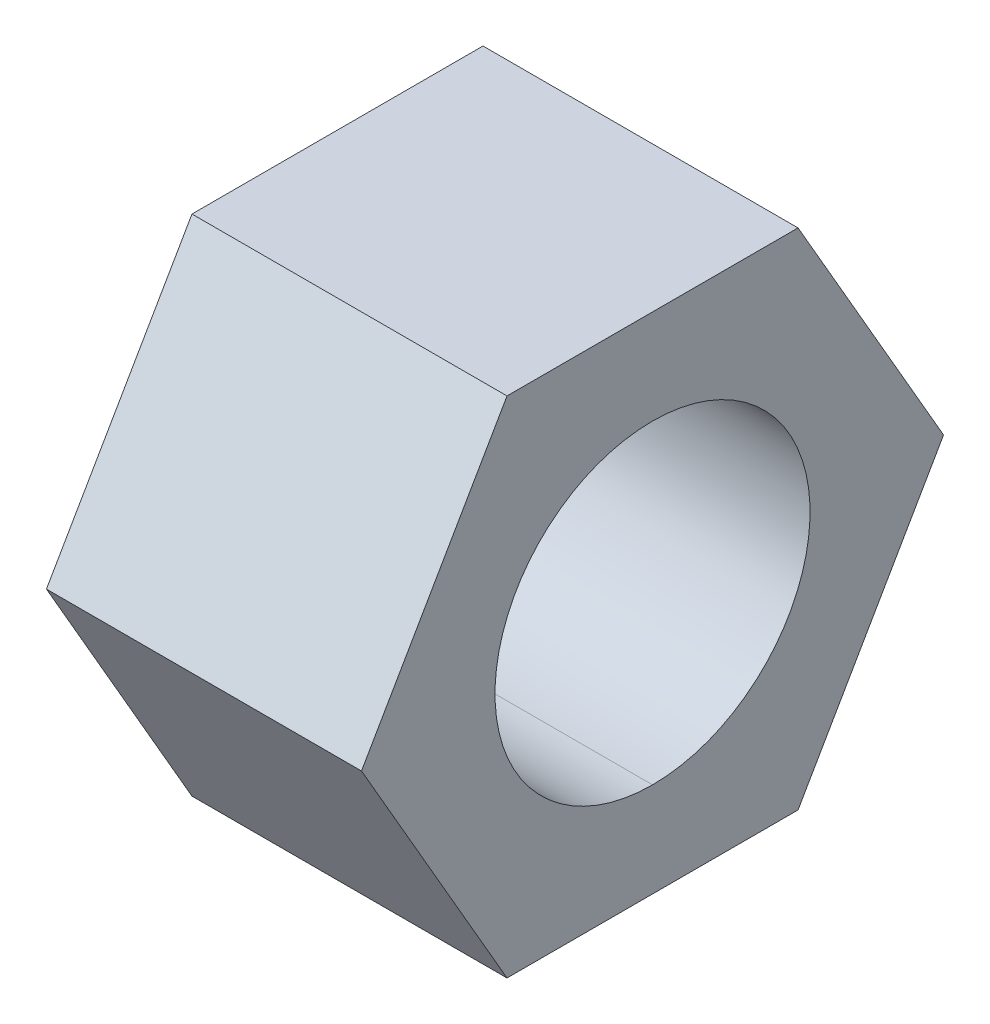
ISO-10303-21;
HEADER;
FILE_DESCRIPTION(('STEP AP214'),'2;1');
FILE_NAME('part.step','',(''),(''),'','','');
FILE_SCHEMA(('AUTOMOTIVE_DESIGN { 1 0 10303 214 1 1 1 1 }'));
ENDSEC;
DATA;
#1=APPLICATION_CONTEXT('core data for automotive mechanical design processes');
#2=APPLICATION_PROTOCOL_DEFINITION('international standard','automotive_design',2000,#1);
#3=PRODUCT_CONTEXT('',#1,'mechanical');
#4=PRODUCT('Part','Part','',(#3));
#5=PRODUCT_RELATED_PRODUCT_CATEGORY('part','',(#4));
#6=PRODUCT_DEFINITION_FORMATION('','',#4);
#7=PRODUCT_DEFINITION_CONTEXT('part definition',#1,'design');
#8=PRODUCT_DEFINITION('design','',#6,#7);
#9=PRODUCT_DEFINITION_SHAPE('','',#8);
#10=(LENGTH_UNIT() NAMED_UNIT(*) SI_UNIT(.MILLI.,.METRE.));
#11=(NAMED_UNIT(*) PLANE_ANGLE_UNIT() SI_UNIT($,.RADIAN.));
#12=(NAMED_UNIT(*) SI_UNIT($,.STERADIAN.) SOLID_ANGLE_UNIT());
#13=UNCERTAINTY_MEASURE_WITH_UNIT(LENGTH_MEASURE(1.E-05),#10,'distance_accuracy_value','');
#14=(GEOMETRIC_REPRESENTATION_CONTEXT(3) GLOBAL_UNCERTAINTY_ASSIGNED_CONTEXT((#13)) GLOBAL_UNIT_ASSIGNED_CONTEXT((#10,
#11,#12)) REPRESENTATION_CONTEXT('',''));
#15=CARTESIAN_POINT('',(0.,0.,0.));
#16=DIRECTION('',(0.,0.,1.));
#17=DIRECTION('',(1.,0.,0.));
#18=AXIS2_PLACEMENT_3D('',#15,#16,#17);
#19=CARTESIAN_POINT('',(4.42692307719271,-3.0769230765323,1.77646236651172));
#20=DIRECTION('',(0.,-1.,0.));
#21=DIRECTION('',(0.,0.,-1.));
#22=AXIS2_PLACEMENT_3D('',#19,#20,#21);
#23=PLANE('',#22);
#24=DIRECTION('',(1.,0.,0.));
#25=VECTOR('',#24,1.);
#26=CARTESIAN_POINT('',(6.3500000000254,-3.0769230765323,1.77646236651172));
#27=LINE('',#26,#25);
#28=CARTESIAN_POINT('',(4.42692307719271,-3.0769230765323,1.77646236651172));
#29=VERTEX_POINT('',#28);
#30=CARTESIAN_POINT('',(8.27307692285809,-3.0769230765323,1.77646236651172));
#31=VERTEX_POINT('',#30);
#32=EDGE_CURVE('E72',#29,#31,#27,.T.);
#33=ORIENTED_EDGE('',*,*,#32,.F.);
#34=DIRECTION('',(0.,0.,-1.));
#35=VECTOR('',#34,1.);
#36=CARTESIAN_POINT('',(4.42692307719271,-3.0769230765323,0.));
#37=LINE('',#36,#35);
#38=CARTESIAN_POINT('',(4.42692307719271,-3.0769230765323,-1.77646236651168));
#39=VERTEX_POINT('',#38);
#40=EDGE_CURVE('E11',#29,#39,#37,.T.);
#41=ORIENTED_EDGE('',*,*,#40,.T.);
#42=DIRECTION('',(1.,0.,0.));
#43=VECTOR('',#42,1.);
#44=CARTESIAN_POINT('',(6.3500000000254,-3.0769230765323,-1.77646236651168));
#45=LINE('',#44,#43);
#46=CARTESIAN_POINT('',(8.27307692285809,-3.0769230765323,-1.77646236651168));
#47=VERTEX_POINT('',#46);
#48=EDGE_CURVE('E59',#39,#47,#45,.T.);
#49=ORIENTED_EDGE('',*,*,#48,.T.);
#50=DIRECTION('',(0.,0.,-1.));
#51=VECTOR('',#50,1.);
#52=CARTESIAN_POINT('',(8.27307692285809,-3.0769230765323,0.));
#53=LINE('',#52,#51);
#54=EDGE_CURVE('E191',#31,#47,#53,.T.);
#55=ORIENTED_EDGE('',*,*,#54,.F.);
#56=EDGE_LOOP('',(#33,#41,#49,#55));
#57=FACE_BOUND('',#56,.T.);
#58=ADVANCED_FACE('F48',(#57),#23,.T.);
#59=CARTESIAN_POINT('',(4.42692307719271,-3.0769230765323,-1.77646236651168));
#60=DIRECTION('',(0.,-0.5,-0.866025403784438));
#61=DIRECTION('',(0.,0.866025403784438,-0.5));
#62=AXIS2_PLACEMENT_3D('',#59,#60,#61);
#63=PLANE('',#62);
#64=ORIENTED_EDGE('',*,*,#48,.F.);
#65=DIRECTION('',(0.,0.866025403784438,-0.5));
#66=VECTOR('',#65,1.);
#67=CARTESIAN_POINT('',(4.42692307719271,-1.53846153826615,-2.66469354976753));
#68=LINE('',#67,#66);
#69=CARTESIAN_POINT('',(4.42692307719271,0.,-3.55292473302338));
#70=VERTEX_POINT('',#69);
#71=EDGE_CURVE('E209',#39,#70,#68,.T.);
#72=ORIENTED_EDGE('',*,*,#71,.T.);
#73=DIRECTION('',(1.,0.,0.));
#74=VECTOR('',#73,1.);
#75=CARTESIAN_POINT('',(6.3500000000254,0.,-3.55292473302338));
#76=LINE('',#75,#74);
#77=CARTESIAN_POINT('',(8.27307692285809,0.,-3.55292473302338));
#78=VERTEX_POINT('',#77);
#79=EDGE_CURVE('E137',#70,#78,#76,.T.);
#80=ORIENTED_EDGE('',*,*,#79,.T.);
#81=DIRECTION('',(0.,0.866025403784438,-0.5));
#82=VECTOR('',#81,1.);
#83=CARTESIAN_POINT('',(8.27307692285809,-1.53846153826615,-2.66469354976753));
#84=LINE('',#83,#82);
#85=EDGE_CURVE('E145',#47,#78,#84,.T.);
#86=ORIENTED_EDGE('',*,*,#85,.F.);
#87=EDGE_LOOP('',(#64,#72,#80,#86));
#88=FACE_BOUND('',#87,.T.);
#89=ADVANCED_FACE('F50',(#88),#63,.T.);
#90=CARTESIAN_POINT('',(4.42692307719271,0.,-3.55292473302338));
#91=DIRECTION('',(0.,0.5,-0.866025403784439));
#92=DIRECTION('',(0.,0.866025403784439,0.5));
#93=AXIS2_PLACEMENT_3D('',#90,#91,#92);
#94=PLANE('',#93);
#95=ORIENTED_EDGE('',*,*,#79,.F.);
#96=DIRECTION('',(0.,0.866025403784439,0.5));
#97=VECTOR('',#96,1.);
#98=CARTESIAN_POINT('',(4.42692307719271,1.53846153826617,-2.66469354976753));
#99=LINE('',#98,#97);
#100=CARTESIAN_POINT('',(4.42692307719271,3.07692307653232,-1.77646236651169));
#101=VERTEX_POINT('',#100);
#102=EDGE_CURVE('E224',#70,#101,#99,.T.);
#103=ORIENTED_EDGE('',*,*,#102,.T.);
#104=DIRECTION('',(1.,0.,0.));
#105=VECTOR('',#104,1.);
#106=CARTESIAN_POINT('',(6.3500000000254,3.07692307653232,-1.77646236651169));
#107=LINE('',#106,#105);
#108=CARTESIAN_POINT('',(8.27307692285809,3.07692307653232,-1.77646236651169));
#109=VERTEX_POINT('',#108);
#110=EDGE_CURVE('E220',#101,#109,#107,.T.);
#111=ORIENTED_EDGE('',*,*,#110,.T.);
#112=DIRECTION('',(0.,0.866025403784439,0.5));
#113=VECTOR('',#112,1.);
#114=CARTESIAN_POINT('',(8.27307692285809,1.53846153826617,-2.66469354976753));
#115=LINE('',#114,#113);
#116=EDGE_CURVE('E52',#78,#109,#115,.T.);
#117=ORIENTED_EDGE('',*,*,#116,.F.);
#118=EDGE_LOOP('',(#95,#103,#111,#117));
#119=FACE_BOUND('',#118,.T.);
#120=ADVANCED_FACE('F239',(#119),#94,.T.);
#121=CARTESIAN_POINT('',(4.42692307719271,3.07692307653232,-1.77646236651169));
#122=DIRECTION('',(0.,1.,0.));
#123=DIRECTION('',(0.,0.,1.));
#124=AXIS2_PLACEMENT_3D('',#121,#122,#123);
#125=PLANE('',#124);
#126=ORIENTED_EDGE('',*,*,#110,.F.);
#127=DIRECTION('',(0.,0.,1.));
#128=VECTOR('',#127,1.);
#129=CARTESIAN_POINT('',(4.42692307719271,3.07692307653232,0.));
#130=LINE('',#129,#128);
#131=CARTESIAN_POINT('',(4.42692307719271,3.07692307653232,1.77646236651172));
#132=VERTEX_POINT('',#131);
#133=EDGE_CURVE('E190',#101,#132,#130,.T.);
#134=ORIENTED_EDGE('',*,*,#133,.T.);
#135=DIRECTION('',(1.,0.,0.));
#136=VECTOR('',#135,1.);
#137=CARTESIAN_POINT('',(6.3500000000254,3.07692307653232,1.77646236651172));
#138=LINE('',#137,#136);
#139=CARTESIAN_POINT('',(8.27307692285809,3.07692307653232,1.77646236651172));
#140=VERTEX_POINT('',#139);
#141=EDGE_CURVE('E210',#132,#140,#138,.T.);
#142=ORIENTED_EDGE('',*,*,#141,.T.);
#143=DIRECTION('',(0.,0.,1.));
#144=VECTOR('',#143,1.);
#145=CARTESIAN_POINT('',(8.27307692285809,3.07692307653232,0.));
#146=LINE('',#145,#144);
#147=EDGE_CURVE('E96',#109,#140,#146,.T.);
#148=ORIENTED_EDGE('',*,*,#147,.F.);
#149=EDGE_LOOP('',(#126,#134,#142,#148));
#150=FACE_BOUND('',#149,.T.);
#151=ADVANCED_FACE('F345',(#150),#125,.T.);
#152=CARTESIAN_POINT('',(4.42692307719271,3.07692307653232,1.77646236651172));
#153=DIRECTION('',(0.,0.5,0.866025403784441));
#154=DIRECTION('',(0.,-0.866025403784441,0.5));
#155=AXIS2_PLACEMENT_3D('',#152,#153,#154);
#156=PLANE('',#155);
#157=ORIENTED_EDGE('',*,*,#141,.F.);
#158=DIRECTION('',(0.,-0.866025403784441,0.5));
#159=VECTOR('',#158,1.);
#160=CARTESIAN_POINT('',(4.42692307719271,1.53846153826616,2.66469354976757));
#161=LINE('',#160,#159);
#162=CARTESIAN_POINT('',(4.42692307719271,0.,3.55292473302342));
#163=VERTEX_POINT('',#162);
#164=EDGE_CURVE('E213',#132,#163,#161,.T.);
#165=ORIENTED_EDGE('',*,*,#164,.T.);
#166=DIRECTION('',(1.,0.,0.));
#167=VECTOR('',#166,1.);
#168=CARTESIAN_POINT('',(6.3500000000254,0.,3.55292473302342));
#169=LINE('',#168,#167);
#170=CARTESIAN_POINT('',(8.27307692285809,0.,3.55292473302342));
#171=VERTEX_POINT('',#170);
#172=EDGE_CURVE('E111',#163,#171,#169,.T.);
#173=ORIENTED_EDGE('',*,*,#172,.T.);
#174=DIRECTION('',(0.,-0.866025403784441,0.5));
#175=VECTOR('',#174,1.);
#176=CARTESIAN_POINT('',(8.27307692285809,1.53846153826616,2.66469354976757));
#177=LINE('',#176,#175);
#178=EDGE_CURVE('E200',#140,#171,#177,.T.);
#179=ORIENTED_EDGE('',*,*,#178,.F.);
#180=EDGE_LOOP('',(#157,#165,#173,#179));
#181=FACE_BOUND('',#180,.T.);
#182=ADVANCED_FACE('F356',(#181),#156,.T.);
#183=CARTESIAN_POINT('',(4.42692307719271,0.,3.55292473302341));
#184=DIRECTION('',(0.,-0.5,0.866025403784438));
#185=DIRECTION('',(0.,-0.866025403784438,-0.5));
#186=AXIS2_PLACEMENT_3D('',#183,#184,#185);
#187=PLANE('',#186);
#188=ORIENTED_EDGE('',*,*,#172,.F.);
#189=DIRECTION('',(0.,-0.866025403784438,-0.5));
#190=VECTOR('',#189,1.);
#191=CARTESIAN_POINT('',(4.42692307719271,-1.53846153826615,2.66469354976757));
#192=LINE('',#191,#190);
#193=EDGE_CURVE('E197',#163,#29,#192,.T.);
#194=ORIENTED_EDGE('',*,*,#193,.T.);
#195=ORIENTED_EDGE('',*,*,#32,.T.);
#196=DIRECTION('',(0.,-0.866025403784438,-0.5));
#197=VECTOR('',#196,1.);
#198=CARTESIAN_POINT('',(8.27307692285809,-1.53846153826615,2.66469354976757));
#199=LINE('',#198,#197);
#200=EDGE_CURVE('E203',#171,#31,#199,.T.);
#201=ORIENTED_EDGE('',*,*,#200,.F.);
#202=EDGE_LOOP('',(#188,#194,#195,#201));
#203=FACE_BOUND('',#202,.T.);
#204=ADVANCED_FACE('F364',(#203),#187,.T.);
#205=CARTESIAN_POINT('',(6.3500000000254,0.,0.));
#206=DIRECTION('',(-1.,0.,0.));
#207=DIRECTION('',(0.,1.,0.));
#208=AXIS2_PLACEMENT_3D('',#205,#206,#207);
#209=CYLINDRICAL_SURFACE('',#208,1.92307692283269);
#210=CARTESIAN_POINT('',(8.27307692285809,0.,0.));
#211=DIRECTION('',(1.,0.,0.));
#212=DIRECTION('',(0.,1.,0.));
#213=AXIS2_PLACEMENT_3D('',#210,#211,#212);
#214=CIRCLE('',#213,1.92307692283269);
#215=CARTESIAN_POINT('',(8.27307692285809,-1.92307692283268,0.));
#216=VERTEX_POINT('',#215);
#217=CARTESIAN_POINT('',(8.27307692285809,1.9230769228327,0.));
#218=VERTEX_POINT('',#217);
#219=EDGE_CURVE('E173',#216,#218,#214,.T.);
#220=ORIENTED_EDGE('',*,*,#219,.T.);
#221=DIRECTION('',(1.,0.,0.));
#222=VECTOR('',#221,1.);
#223=CARTESIAN_POINT('',(6.3500000000254,1.9230769228327,0.));
#224=LINE('',#223,#222);
#225=CARTESIAN_POINT('',(4.42692307719271,1.9230769228327,0.));
#226=VERTEX_POINT('',#225);
#227=EDGE_CURVE('E159',#226,#218,#224,.T.);
#228=ORIENTED_EDGE('',*,*,#227,.F.);
#229=CARTESIAN_POINT('',(4.42692307719271,0.,0.));
#230=DIRECTION('',(1.,0.,0.));
#231=DIRECTION('',(0.,1.,0.));
#232=AXIS2_PLACEMENT_3D('',#229,#230,#231);
#233=CIRCLE('',#232,1.92307692283269);
#234=CARTESIAN_POINT('',(4.42692307719271,-1.92307692283268,0.));
#235=VERTEX_POINT('',#234);
#236=EDGE_CURVE('E193',#235,#226,#233,.T.);
#237=ORIENTED_EDGE('',*,*,#236,.F.);
#238=DIRECTION('',(1.,0.,0.));
#239=VECTOR('',#238,1.);
#240=CARTESIAN_POINT('',(6.3500000000254,-1.92307692283268,0.));
#241=LINE('',#240,#239);
#242=EDGE_CURVE('E176',#235,#216,#241,.T.);
#243=ORIENTED_EDGE('',*,*,#242,.T.);
#244=EDGE_LOOP('',(#220,#228,#237,#243));
#245=FACE_BOUND('',#244,.T.);
#246=ADVANCED_FACE('F175',(#245),#209,.F.);
#247=CARTESIAN_POINT('',(6.3500000000254,0.,0.));
#248=DIRECTION('',(-1.,0.,0.));
#249=DIRECTION('',(0.,1.,0.));
#250=AXIS2_PLACEMENT_3D('',#247,#248,#249);
#251=CYLINDRICAL_SURFACE('',#250,1.92307692283269);
#252=CARTESIAN_POINT('',(8.27307692285809,0.,0.));
#253=DIRECTION('',(1.,0.,0.));
#254=DIRECTION('',(0.,1.,0.));
#255=AXIS2_PLACEMENT_3D('',#252,#253,#254);
#256=CIRCLE('',#255,1.92307692283269);
#257=EDGE_CURVE('E165',#218,#216,#256,.T.);
#258=ORIENTED_EDGE('',*,*,#257,.T.);
#259=ORIENTED_EDGE('',*,*,#242,.F.);
#260=CARTESIAN_POINT('',(4.42692307719271,0.,0.));
#261=DIRECTION('',(1.,0.,0.));
#262=DIRECTION('',(0.,1.,0.));
#263=AXIS2_PLACEMENT_3D('',#260,#261,#262);
#264=CIRCLE('',#263,1.92307692283269);
#265=EDGE_CURVE('E167',#226,#235,#264,.T.);
#266=ORIENTED_EDGE('',*,*,#265,.F.);
#267=ORIENTED_EDGE('',*,*,#227,.T.);
#268=EDGE_LOOP('',(#258,#259,#266,#267));
#269=FACE_BOUND('',#268,.T.);
#270=ADVANCED_FACE('F162',(#269),#251,.F.);
#271=CARTESIAN_POINT('',(4.42692307719271,0.,0.));
#272=DIRECTION('',(1.,0.,0.));
#273=DIRECTION('',(0.,1.,0.));
#274=AXIS2_PLACEMENT_3D('',#271,#272,#273);
#275=PLANE('',#274);
#276=ORIENTED_EDGE('',*,*,#193,.F.);
#277=ORIENTED_EDGE('',*,*,#164,.F.);
#278=ORIENTED_EDGE('',*,*,#133,.F.);
#279=ORIENTED_EDGE('',*,*,#102,.F.);
#280=ORIENTED_EDGE('',*,*,#71,.F.);
#281=ORIENTED_EDGE('',*,*,#40,.F.);
#282=EDGE_LOOP('',(#276,#277,#278,#279,#280,#281));
#283=FACE_BOUND('',#282,.T.);
#284=ORIENTED_EDGE('',*,*,#265,.T.);
#285=ORIENTED_EDGE('',*,*,#236,.T.);
#286=EDGE_LOOP('',(#284,#285));
#287=FACE_BOUND('',#286,.T.);
#288=ADVANCED_FACE('F246',(#283,#287),#275,.F.);
#289=CARTESIAN_POINT('',(8.27307692285809,0.,0.));
#290=DIRECTION('',(1.,0.,0.));
#291=DIRECTION('',(0.,1.,0.));
#292=AXIS2_PLACEMENT_3D('',#289,#290,#291);
#293=PLANE('',#292);
#294=ORIENTED_EDGE('',*,*,#54,.T.);
#295=ORIENTED_EDGE('',*,*,#85,.T.);
#296=ORIENTED_EDGE('',*,*,#116,.T.);
#297=ORIENTED_EDGE('',*,*,#147,.T.);
#298=ORIENTED_EDGE('',*,*,#178,.T.);
#299=ORIENTED_EDGE('',*,*,#200,.T.);
#300=EDGE_LOOP('',(#294,#295,#296,#297,#298,#299));
#301=FACE_BOUND('',#300,.T.);
#302=ORIENTED_EDGE('',*,*,#219,.F.);
#303=ORIENTED_EDGE('',*,*,#257,.F.);
#304=EDGE_LOOP('',(#302,#303));
#305=FACE_BOUND('',#304,.T.);
#306=ADVANCED_FACE('F181',(#301,#305),#293,.T.);
#307=CLOSED_SHELL('',(#58,#89,#120,#151,#182,#204,#246,#270,#288,#306));
#308=MANIFOLD_SOLID_BREP('B2',#307);
#309=ADVANCED_BREP_SHAPE_REPRESENTATION('',(#18,#308),#14);
#310=SHAPE_DEFINITION_REPRESENTATION(#9,#309);
ENDSEC;
END-ISO-10303-21;
